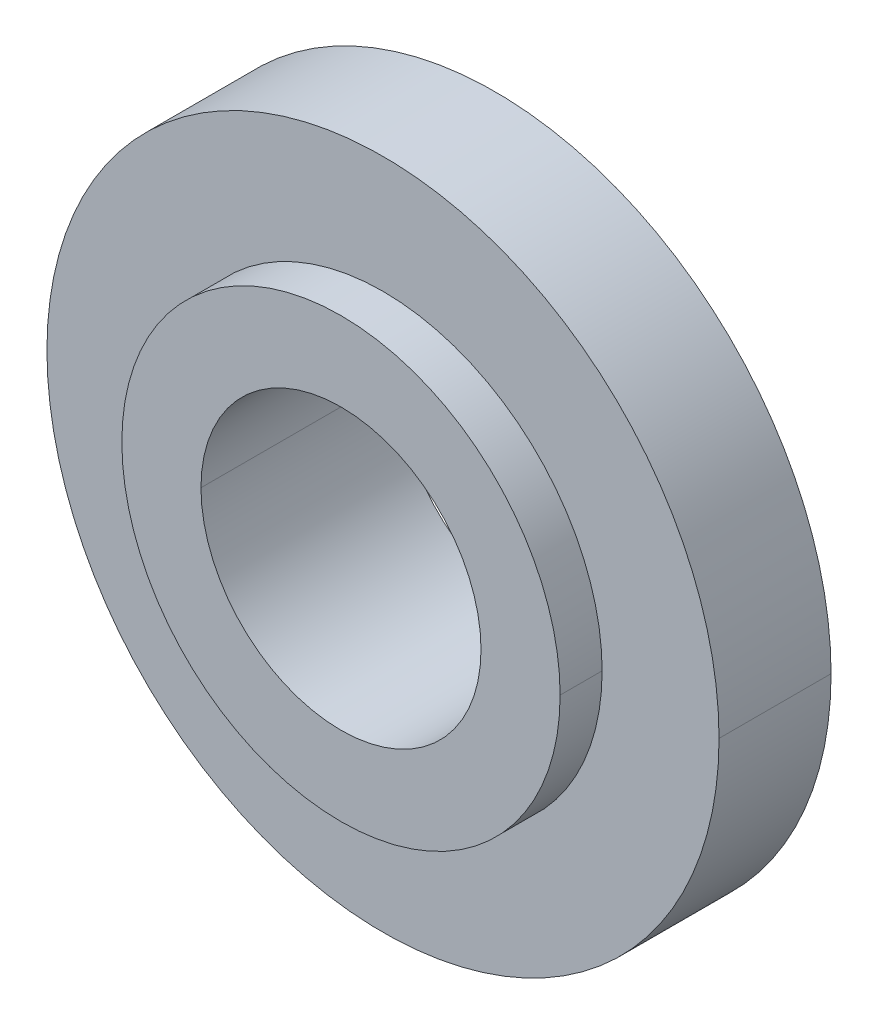
ISO-10303-21;
HEADER;
FILE_DESCRIPTION(('STEP AP214'),'2;1');
FILE_NAME('part.step','',(''),(''),'','','');
FILE_SCHEMA(('AUTOMOTIVE_DESIGN { 1 0 10303 214 1 1 1 1 }'));
ENDSEC;
DATA;
#1=APPLICATION_CONTEXT('core data for automotive mechanical design processes');
#2=APPLICATION_PROTOCOL_DEFINITION('international standard','automotive_design',2000,#1);
#3=PRODUCT_CONTEXT('',#1,'mechanical');
#4=PRODUCT('Part','Part','',(#3));
#5=PRODUCT_RELATED_PRODUCT_CATEGORY('part','',(#4));
#6=PRODUCT_DEFINITION_FORMATION('','',#4);
#7=PRODUCT_DEFINITION_CONTEXT('part definition',#1,'design');
#8=PRODUCT_DEFINITION('design','',#6,#7);
#9=PRODUCT_DEFINITION_SHAPE('','',#8);
#10=(LENGTH_UNIT() NAMED_UNIT(*) SI_UNIT(.MILLI.,.METRE.));
#11=(NAMED_UNIT(*) PLANE_ANGLE_UNIT() SI_UNIT($,.RADIAN.));
#12=(NAMED_UNIT(*) SI_UNIT($,.STERADIAN.) SOLID_ANGLE_UNIT());
#13=UNCERTAINTY_MEASURE_WITH_UNIT(LENGTH_MEASURE(1.E-05),#10,'distance_accuracy_value','');
#14=(GEOMETRIC_REPRESENTATION_CONTEXT(3) GLOBAL_UNCERTAINTY_ASSIGNED_CONTEXT((#13)) GLOBAL_UNIT_ASSIGNED_CONTEXT((#10,
#11,#12)) REPRESENTATION_CONTEXT('',''));
#15=CARTESIAN_POINT('',(0.,0.,0.));
#16=DIRECTION('',(0.,0.,1.));
#17=DIRECTION('',(1.,0.,0.));
#18=AXIS2_PLACEMENT_3D('',#15,#16,#17);
#19=CARTESIAN_POINT('',(0.,0.,0.7));
#20=DIRECTION('',(0.,0.,-1.));
#21=DIRECTION('',(-1.,0.,0.));
#22=AXIS2_PLACEMENT_3D('',#19,#20,#21);
#23=CYLINDRICAL_SURFACE('',#22,1.565);
#24=DIRECTION('',(0.,0.,-1.));
#25=VECTOR('',#24,1.);
#26=CARTESIAN_POINT('',(1.565,0.,0.7));
#27=LINE('',#26,#25);
#28=CARTESIAN_POINT('',(1.565,0.,0.7));
#29=VERTEX_POINT('',#28);
#30=CARTESIAN_POINT('',(1.565,0.,0.4));
#31=VERTEX_POINT('',#30);
#32=EDGE_CURVE('E144',#29,#31,#27,.T.);
#33=ORIENTED_EDGE('',*,*,#32,.F.);
#34=CARTESIAN_POINT('',(0.,0.,0.7));
#35=DIRECTION('',(0.,0.,1.));
#36=DIRECTION('',(1.,0.,0.));
#37=AXIS2_PLACEMENT_3D('',#34,#35,#36);
#38=CIRCLE('',#37,1.565);
#39=CARTESIAN_POINT('',(-1.565,0.,0.7));
#40=VERTEX_POINT('',#39);
#41=EDGE_CURVE('E11',#40,#29,#38,.T.);
#42=ORIENTED_EDGE('',*,*,#41,.F.);
#43=DIRECTION('',(0.,0.,-1.));
#44=VECTOR('',#43,1.);
#45=CARTESIAN_POINT('',(-1.565,0.,0.7));
#46=LINE('',#45,#44);
#47=CARTESIAN_POINT('',(-1.565,0.,0.4));
#48=VERTEX_POINT('',#47);
#49=EDGE_CURVE('E143',#40,#48,#46,.T.);
#50=ORIENTED_EDGE('',*,*,#49,.T.);
#51=CARTESIAN_POINT('',(0.,0.,0.4));
#52=DIRECTION('',(0.,0.,-1.));
#53=DIRECTION('',(1.,0.,0.));
#54=AXIS2_PLACEMENT_3D('',#51,#52,#53);
#55=CIRCLE('',#54,1.565);
#56=EDGE_CURVE('E176',#31,#48,#55,.T.);
#57=ORIENTED_EDGE('',*,*,#56,.F.);
#58=EDGE_LOOP('',(#33,#42,#50,#57));
#59=FACE_BOUND('',#58,.T.);
#60=ADVANCED_FACE('F17',(#59),#23,.T.);
#61=CARTESIAN_POINT('',(0.,0.,0.7));
#62=DIRECTION('',(0.,0.,1.));
#63=DIRECTION('',(1.,0.,0.));
#64=AXIS2_PLACEMENT_3D('',#61,#62,#63);
#65=PLANE('',#64);
#66=CARTESIAN_POINT('',(0.,0.,0.7));
#67=DIRECTION('',(0.,0.,1.));
#68=DIRECTION('',(1.,0.,0.));
#69=AXIS2_PLACEMENT_3D('',#66,#67,#68);
#70=CIRCLE('',#69,1.);
#71=CARTESIAN_POINT('',(-1.,0.,0.7));
#72=VERTEX_POINT('',#71);
#73=CARTESIAN_POINT('',(1.,0.,0.7));
#74=VERTEX_POINT('',#73);
#75=EDGE_CURVE('E148',#72,#74,#70,.T.);
#76=ORIENTED_EDGE('',*,*,#75,.F.);
#77=CARTESIAN_POINT('',(0.,0.,0.7));
#78=DIRECTION('',(0.,0.,1.));
#79=DIRECTION('',(1.,0.,0.));
#80=AXIS2_PLACEMENT_3D('',#77,#78,#79);
#81=CIRCLE('',#80,1.);
#82=EDGE_CURVE('E20',#74,#72,#81,.T.);
#83=ORIENTED_EDGE('',*,*,#82,.F.);
#84=EDGE_LOOP('',(#76,#83));
#85=FACE_BOUND('',#84,.T.);
#86=ORIENTED_EDGE('',*,*,#41,.T.);
#87=CARTESIAN_POINT('',(0.,0.,0.7));
#88=DIRECTION('',(0.,0.,1.));
#89=DIRECTION('',(1.,0.,0.));
#90=AXIS2_PLACEMENT_3D('',#87,#88,#89);
#91=CIRCLE('',#90,1.565);
#92=EDGE_CURVE('E206',#29,#40,#91,.T.);
#93=ORIENTED_EDGE('',*,*,#92,.T.);
#94=EDGE_LOOP('',(#86,#93));
#95=FACE_BOUND('',#94,.T.);
#96=ADVANCED_FACE('F200',(#85,#95),#65,.T.);
#97=CARTESIAN_POINT('',(0.,0.,0.4));
#98=DIRECTION('',(0.,0.,-1.));
#99=DIRECTION('',(-1.,0.,0.));
#100=AXIS2_PLACEMENT_3D('',#97,#98,#99);
#101=CYLINDRICAL_SURFACE('',#100,1.);
#102=DIRECTION('',(0.,0.,-1.));
#103=VECTOR('',#102,1.);
#104=CARTESIAN_POINT('',(1.,0.,0.4));
#105=LINE('',#104,#103);
#106=CARTESIAN_POINT('',(1.,0.,-0.7));
#107=VERTEX_POINT('',#106);
#108=EDGE_CURVE('E153',#74,#107,#105,.T.);
#109=ORIENTED_EDGE('',*,*,#108,.F.);
#110=ORIENTED_EDGE('',*,*,#82,.T.);
#111=DIRECTION('',(0.,0.,-1.));
#112=VECTOR('',#111,1.);
#113=CARTESIAN_POINT('',(-1.,0.,0.4));
#114=LINE('',#113,#112);
#115=CARTESIAN_POINT('',(-1.,0.,-0.7));
#116=VERTEX_POINT('',#115);
#117=EDGE_CURVE('E138',#72,#116,#114,.T.);
#118=ORIENTED_EDGE('',*,*,#117,.T.);
#119=CARTESIAN_POINT('',(0.,0.,-0.7));
#120=DIRECTION('',(0.,0.,1.));
#121=DIRECTION('',(1.,0.,0.));
#122=AXIS2_PLACEMENT_3D('',#119,#120,#121);
#123=CIRCLE('',#122,1.);
#124=EDGE_CURVE('E113',#107,#116,#123,.T.);
#125=ORIENTED_EDGE('',*,*,#124,.F.);
#126=EDGE_LOOP('',(#109,#110,#118,#125));
#127=FACE_BOUND('',#126,.T.);
#128=ADVANCED_FACE('F194',(#127),#101,.F.);
#129=CARTESIAN_POINT('',(0.,0.,-0.7));
#130=DIRECTION('',(0.,0.,1.));
#131=DIRECTION('',(1.,0.,0.));
#132=AXIS2_PLACEMENT_3D('',#129,#130,#131);
#133=PLANE('',#132);
#134=CARTESIAN_POINT('',(0.,0.,-0.7));
#135=DIRECTION('',(0.,0.,1.));
#136=DIRECTION('',(1.,0.,0.));
#137=AXIS2_PLACEMENT_3D('',#134,#135,#136);
#138=CIRCLE('',#137,1.);
#139=EDGE_CURVE('E149',#116,#107,#138,.T.);
#140=ORIENTED_EDGE('',*,*,#139,.T.);
#141=ORIENTED_EDGE('',*,*,#124,.T.);
#142=EDGE_LOOP('',(#140,#141));
#143=FACE_BOUND('',#142,.T.);
#144=CARTESIAN_POINT('',(0.,0.,-0.7));
#145=DIRECTION('',(0.,0.,1.));
#146=DIRECTION('',(1.,0.,0.));
#147=AXIS2_PLACEMENT_3D('',#144,#145,#146);
#148=CIRCLE('',#147,1.565);
#149=CARTESIAN_POINT('',(-1.565,0.,-0.7));
#150=VERTEX_POINT('',#149);
#151=CARTESIAN_POINT('',(1.565,0.,-0.7));
#152=VERTEX_POINT('',#151);
#153=EDGE_CURVE('E104',#150,#152,#148,.T.);
#154=ORIENTED_EDGE('',*,*,#153,.F.);
#155=CARTESIAN_POINT('',(0.,0.,-0.7));
#156=DIRECTION('',(0.,0.,1.));
#157=DIRECTION('',(1.,0.,0.));
#158=AXIS2_PLACEMENT_3D('',#155,#156,#157);
#159=CIRCLE('',#158,1.565);
#160=EDGE_CURVE('E108',#152,#150,#159,.T.);
#161=ORIENTED_EDGE('',*,*,#160,.F.);
#162=EDGE_LOOP('',(#154,#161));
#163=FACE_BOUND('',#162,.T.);
#164=ADVANCED_FACE('F106',(#143,#163),#133,.F.);
#165=CARTESIAN_POINT('',(0.,0.,0.7));
#166=DIRECTION('',(0.,0.,-1.));
#167=DIRECTION('',(-1.,0.,0.));
#168=AXIS2_PLACEMENT_3D('',#165,#166,#167);
#169=CYLINDRICAL_SURFACE('',#168,1.565);
#170=DIRECTION('',(0.,0.,-1.));
#171=VECTOR('',#170,1.);
#172=CARTESIAN_POINT('',(1.565,0.,0.7));
#173=LINE('',#172,#171);
#174=CARTESIAN_POINT('',(1.565,0.,-0.4));
#175=VERTEX_POINT('',#174);
#176=EDGE_CURVE('E126',#175,#152,#173,.T.);
#177=ORIENTED_EDGE('',*,*,#176,.F.);
#178=CARTESIAN_POINT('',(0.,0.,-0.4));
#179=DIRECTION('',(0.,0.,-1.));
#180=DIRECTION('',(1.,0.,0.));
#181=AXIS2_PLACEMENT_3D('',#178,#179,#180);
#182=CIRCLE('',#181,1.565);
#183=CARTESIAN_POINT('',(-1.565,0.,-0.4));
#184=VERTEX_POINT('',#183);
#185=EDGE_CURVE('E114',#175,#184,#182,.T.);
#186=ORIENTED_EDGE('',*,*,#185,.T.);
#187=DIRECTION('',(0.,0.,-1.));
#188=VECTOR('',#187,1.);
#189=CARTESIAN_POINT('',(-1.565,0.,0.7));
#190=LINE('',#189,#188);
#191=EDGE_CURVE('E117',#184,#150,#190,.T.);
#192=ORIENTED_EDGE('',*,*,#191,.T.);
#193=ORIENTED_EDGE('',*,*,#153,.T.);
#194=EDGE_LOOP('',(#177,#186,#192,#193));
#195=FACE_BOUND('',#194,.T.);
#196=ADVANCED_FACE('F118',(#195),#169,.T.);
#197=CARTESIAN_POINT('',(0.,0.,0.4));
#198=DIRECTION('',(0.,0.,-1.));
#199=DIRECTION('',(-1.,0.,0.));
#200=AXIS2_PLACEMENT_3D('',#197,#198,#199);
#201=CYLINDRICAL_SURFACE('',#200,2.4);
#202=DIRECTION('',(0.,0.,-1.));
#203=VECTOR('',#202,1.);
#204=CARTESIAN_POINT('',(2.4,0.,0.4));
#205=LINE('',#204,#203);
#206=CARTESIAN_POINT('',(2.4,0.,0.4));
#207=VERTEX_POINT('',#206);
#208=CARTESIAN_POINT('',(2.4,0.,-0.4));
#209=VERTEX_POINT('',#208);
#210=EDGE_CURVE('E164',#207,#209,#205,.T.);
#211=ORIENTED_EDGE('',*,*,#210,.F.);
#212=CARTESIAN_POINT('',(0.,0.,0.4));
#213=DIRECTION('',(0.,0.,1.));
#214=DIRECTION('',(1.,0.,0.));
#215=AXIS2_PLACEMENT_3D('',#212,#213,#214);
#216=CIRCLE('',#215,2.4);
#217=CARTESIAN_POINT('',(-2.4,0.,0.4));
#218=VERTEX_POINT('',#217);
#219=EDGE_CURVE('E173',#218,#207,#216,.T.);
#220=ORIENTED_EDGE('',*,*,#219,.F.);
#221=DIRECTION('',(0.,0.,-1.));
#222=VECTOR('',#221,1.);
#223=CARTESIAN_POINT('',(-2.4,0.,0.4));
#224=LINE('',#223,#222);
#225=CARTESIAN_POINT('',(-2.4,0.,-0.4));
#226=VERTEX_POINT('',#225);
#227=EDGE_CURVE('E170',#218,#226,#224,.T.);
#228=ORIENTED_EDGE('',*,*,#227,.T.);
#229=CARTESIAN_POINT('',(0.,0.,-0.4));
#230=DIRECTION('',(0.,0.,1.));
#231=DIRECTION('',(1.,0.,0.));
#232=AXIS2_PLACEMENT_3D('',#229,#230,#231);
#233=CIRCLE('',#232,2.4);
#234=EDGE_CURVE('E38',#226,#209,#233,.T.);
#235=ORIENTED_EDGE('',*,*,#234,.T.);
#236=EDGE_LOOP('',(#211,#220,#228,#235));
#237=FACE_BOUND('',#236,.T.);
#238=ADVANCED_FACE('F227',(#237),#201,.T.);
#239=CARTESIAN_POINT('',(0.,0.,-0.4));
#240=DIRECTION('',(0.,0.,1.));
#241=DIRECTION('',(1.,0.,0.));
#242=AXIS2_PLACEMENT_3D('',#239,#240,#241);
#243=PLANE('',#242);
#244=CARTESIAN_POINT('',(0.,0.,-0.4));
#245=DIRECTION('',(0.,0.,-1.));
#246=DIRECTION('',(1.,0.,0.));
#247=AXIS2_PLACEMENT_3D('',#244,#245,#246);
#248=CIRCLE('',#247,1.565);
#249=EDGE_CURVE('E134',#184,#175,#248,.T.);
#250=ORIENTED_EDGE('',*,*,#249,.F.);
#251=ORIENTED_EDGE('',*,*,#185,.F.);
#252=EDGE_LOOP('',(#250,#251));
#253=FACE_BOUND('',#252,.T.);
#254=ORIENTED_EDGE('',*,*,#234,.F.);
#255=CARTESIAN_POINT('',(0.,0.,-0.4));
#256=DIRECTION('',(0.,0.,1.));
#257=DIRECTION('',(1.,0.,0.));
#258=AXIS2_PLACEMENT_3D('',#255,#256,#257);
#259=CIRCLE('',#258,2.4);
#260=EDGE_CURVE('E166',#209,#226,#259,.T.);
#261=ORIENTED_EDGE('',*,*,#260,.F.);
#262=EDGE_LOOP('',(#254,#261));
#263=FACE_BOUND('',#262,.T.);
#264=ADVANCED_FACE('F231',(#253,#263),#243,.F.);
#265=CARTESIAN_POINT('',(0.,0.,0.4));
#266=DIRECTION('',(0.,0.,1.));
#267=DIRECTION('',(1.,0.,0.));
#268=AXIS2_PLACEMENT_3D('',#265,#266,#267);
#269=PLANE('',#268);
#270=CARTESIAN_POINT('',(0.,0.,0.4));
#271=DIRECTION('',(0.,0.,-1.));
#272=DIRECTION('',(1.,0.,0.));
#273=AXIS2_PLACEMENT_3D('',#270,#271,#272);
#274=CIRCLE('',#273,1.565);
#275=EDGE_CURVE('E140',#48,#31,#274,.T.);
#276=ORIENTED_EDGE('',*,*,#275,.T.);
#277=ORIENTED_EDGE('',*,*,#56,.T.);
#278=EDGE_LOOP('',(#276,#277));
#279=FACE_BOUND('',#278,.T.);
#280=ORIENTED_EDGE('',*,*,#219,.T.);
#281=CARTESIAN_POINT('',(0.,0.,0.4));
#282=DIRECTION('',(0.,0.,1.));
#283=DIRECTION('',(1.,0.,0.));
#284=AXIS2_PLACEMENT_3D('',#281,#282,#283);
#285=CIRCLE('',#284,2.4);
#286=EDGE_CURVE('E123',#207,#218,#285,.T.);
#287=ORIENTED_EDGE('',*,*,#286,.T.);
#288=EDGE_LOOP('',(#280,#287));
#289=FACE_BOUND('',#288,.T.);
#290=ADVANCED_FACE('F229',(#279,#289),#269,.T.);
#291=CARTESIAN_POINT('',(0.,0.,0.4));
#292=DIRECTION('',(0.,0.,-1.));
#293=DIRECTION('',(-1.,0.,0.));
#294=AXIS2_PLACEMENT_3D('',#291,#292,#293);
#295=CYLINDRICAL_SURFACE('',#294,2.4);
#296=ORIENTED_EDGE('',*,*,#286,.F.);
#297=ORIENTED_EDGE('',*,*,#210,.T.);
#298=ORIENTED_EDGE('',*,*,#260,.T.);
#299=ORIENTED_EDGE('',*,*,#227,.F.);
#300=EDGE_LOOP('',(#296,#297,#298,#299));
#301=FACE_BOUND('',#300,.T.);
#302=ADVANCED_FACE('F225',(#301),#295,.T.);
#303=CARTESIAN_POINT('',(0.,0.,0.7));
#304=DIRECTION('',(0.,0.,-1.));
#305=DIRECTION('',(-1.,0.,0.));
#306=AXIS2_PLACEMENT_3D('',#303,#304,#305);
#307=CYLINDRICAL_SURFACE('',#306,1.565);
#308=ORIENTED_EDGE('',*,*,#249,.T.);
#309=ORIENTED_EDGE('',*,*,#176,.T.);
#310=ORIENTED_EDGE('',*,*,#160,.T.);
#311=ORIENTED_EDGE('',*,*,#191,.F.);
#312=EDGE_LOOP('',(#308,#309,#310,#311));
#313=FACE_BOUND('',#312,.T.);
#314=ADVANCED_FACE('F125',(#313),#307,.T.);
#315=CARTESIAN_POINT('',(0.,0.,0.4));
#316=DIRECTION('',(0.,0.,-1.));
#317=DIRECTION('',(-1.,0.,0.));
#318=AXIS2_PLACEMENT_3D('',#315,#316,#317);
#319=CYLINDRICAL_SURFACE('',#318,1.);
#320=ORIENTED_EDGE('',*,*,#75,.T.);
#321=ORIENTED_EDGE('',*,*,#108,.T.);
#322=ORIENTED_EDGE('',*,*,#139,.F.);
#323=ORIENTED_EDGE('',*,*,#117,.F.);
#324=EDGE_LOOP('',(#320,#321,#322,#323));
#325=FACE_BOUND('',#324,.T.);
#326=ADVANCED_FACE('F199',(#325),#319,.F.);
#327=CARTESIAN_POINT('',(0.,0.,0.7));
#328=DIRECTION('',(0.,0.,-1.));
#329=DIRECTION('',(-1.,0.,0.));
#330=AXIS2_PLACEMENT_3D('',#327,#328,#329);
#331=CYLINDRICAL_SURFACE('',#330,1.565);
#332=ORIENTED_EDGE('',*,*,#92,.F.);
#333=ORIENTED_EDGE('',*,*,#32,.T.);
#334=ORIENTED_EDGE('',*,*,#275,.F.);
#335=ORIENTED_EDGE('',*,*,#49,.F.);
#336=EDGE_LOOP('',(#332,#333,#334,#335));
#337=FACE_BOUND('',#336,.T.);
#338=ADVANCED_FACE('F213',(#337),#331,.T.);
#339=CLOSED_SHELL('',(#60,#96,#128,#164,#196,#238,#264,#290,#302,#314,#326,#338));
#340=MANIFOLD_SOLID_BREP('B1',#339);
#341=ADVANCED_BREP_SHAPE_REPRESENTATION('',(#18,#340),#14);
#342=SHAPE_DEFINITION_REPRESENTATION(#9,#341);
ENDSEC;
END-ISO-10303-21;
